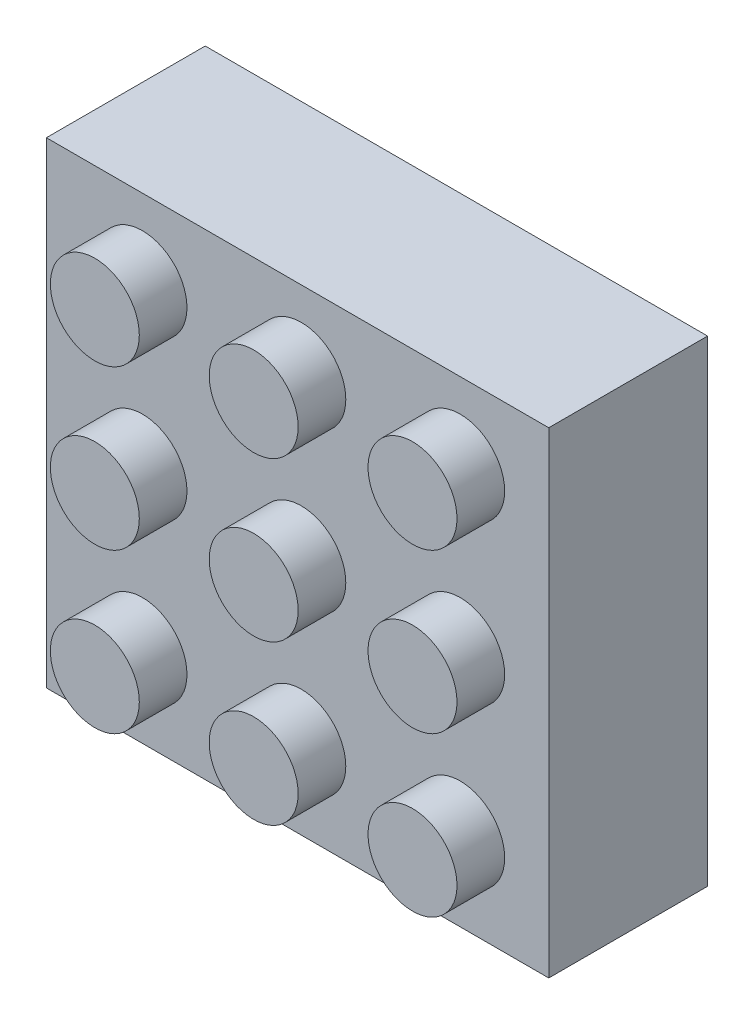
ISO-10303-21;
HEADER;
FILE_DESCRIPTION(('STEP AP214'),'2;1');
FILE_NAME('part.step','',(''),(''),'','','');
FILE_SCHEMA(('AUTOMOTIVE_DESIGN { 1 0 10303 214 1 1 1 1 }'));
ENDSEC;
DATA;
#1=APPLICATION_CONTEXT('core data for automotive mechanical design processes');
#2=APPLICATION_PROTOCOL_DEFINITION('international standard','automotive_design',2000,#1);
#3=PRODUCT_CONTEXT('',#1,'mechanical');
#4=PRODUCT('Part','Part','',(#3));
#5=PRODUCT_RELATED_PRODUCT_CATEGORY('part','',(#4));
#6=PRODUCT_DEFINITION_FORMATION('','',#4);
#7=PRODUCT_DEFINITION_CONTEXT('part definition',#1,'design');
#8=PRODUCT_DEFINITION('design','',#6,#7);
#9=PRODUCT_DEFINITION_SHAPE('','',#8);
#10=(LENGTH_UNIT() NAMED_UNIT(*) SI_UNIT(.MILLI.,.METRE.));
#11=(NAMED_UNIT(*) PLANE_ANGLE_UNIT() SI_UNIT($,.RADIAN.));
#12=(NAMED_UNIT(*) SI_UNIT($,.STERADIAN.) SOLID_ANGLE_UNIT());
#13=UNCERTAINTY_MEASURE_WITH_UNIT(LENGTH_MEASURE(1.E-05),#10,'distance_accuracy_value','');
#14=(GEOMETRIC_REPRESENTATION_CONTEXT(3) GLOBAL_UNCERTAINTY_ASSIGNED_CONTEXT((#13)) GLOBAL_UNIT_ASSIGNED_CONTEXT((#10,
#11,#12)) REPRESENTATION_CONTEXT('',''));
#15=CARTESIAN_POINT('',(0.,0.,0.));
#16=DIRECTION('',(0.,0.,1.));
#17=DIRECTION('',(1.,0.,0.));
#18=AXIS2_PLACEMENT_3D('',#15,#16,#17);
#19=CARTESIAN_POINT('',(1.53626923093681,-12.7149294337279,13.));
#20=DIRECTION('',(0.,0.,1.));
#21=DIRECTION('',(1.,0.,0.));
#22=AXIS2_PLACEMENT_3D('',#19,#20,#21);
#23=PLANE('',#22);
#24=CARTESIAN_POINT('',(1.53626923093681,-12.7149294337279,13.));
#25=DIRECTION('',(0.,0.,1.));
#26=DIRECTION('',(1.,0.,0.));
#27=AXIS2_PLACEMENT_3D('',#24,#25,#26);
#28=CIRCLE('',#27,2.8);
#29=CARTESIAN_POINT('',(4.3362692309368,-12.7149294337279,13.));
#30=VERTEX_POINT('',#29);
#31=EDGE_CURVE('E11',#30,#30,#28,.T.);
#32=ORIENTED_EDGE('',*,*,#31,.T.);
#33=EDGE_LOOP('',(#32));
#34=FACE_BOUND('',#33,.T.);
#35=ADVANCED_FACE('F33',(#34),#23,.T.);
#36=CARTESIAN_POINT('',(1.53626923093681,-12.7149294337279,13.));
#37=DIRECTION('',(0.,0.,-1.));
#38=DIRECTION('',(-1.,0.,0.));
#39=AXIS2_PLACEMENT_3D('',#36,#37,#38);
#40=CYLINDRICAL_SURFACE('',#39,2.8);
#41=ORIENTED_EDGE('',*,*,#31,.F.);
#42=EDGE_LOOP('',(#41));
#43=FACE_BOUND('',#42,.T.);
#44=CARTESIAN_POINT('',(1.53626923093681,-12.7149294337279,10.));
#45=DIRECTION('',(0.,0.,1.));
#46=DIRECTION('',(1.,0.,0.));
#47=AXIS2_PLACEMENT_3D('',#44,#45,#46);
#48=CIRCLE('',#47,2.8);
#49=CARTESIAN_POINT('',(4.3362692309368,-12.7149294337279,10.));
#50=VERTEX_POINT('',#49);
#51=EDGE_CURVE('E40',#50,#50,#48,.T.);
#52=ORIENTED_EDGE('',*,*,#51,.T.);
#53=EDGE_LOOP('',(#52));
#54=FACE_BOUND('',#53,.T.);
#55=ADVANCED_FACE('F141',(#43,#54),#40,.T.);
#56=CARTESIAN_POINT('',(-8.46373076906319,-12.7149294337279,13.));
#57=DIRECTION('',(0.,0.,1.));
#58=DIRECTION('',(1.,0.,0.));
#59=AXIS2_PLACEMENT_3D('',#56,#57,#58);
#60=PLANE('',#59);
#61=CARTESIAN_POINT('',(-8.46373076906319,-12.7149294337279,13.));
#62=DIRECTION('',(0.,0.,1.));
#63=DIRECTION('',(1.,0.,0.));
#64=AXIS2_PLACEMENT_3D('',#61,#62,#63);
#65=CIRCLE('',#64,2.8);
#66=CARTESIAN_POINT('',(-5.6637307690632,-12.7149294337279,13.));
#67=VERTEX_POINT('',#66);
#68=EDGE_CURVE('E136',#67,#67,#65,.T.);
#69=ORIENTED_EDGE('',*,*,#68,.T.);
#70=EDGE_LOOP('',(#69));
#71=FACE_BOUND('',#70,.T.);
#72=ADVANCED_FACE('F161',(#71),#60,.T.);
#73=CARTESIAN_POINT('',(-8.46373076906319,-12.7149294337279,13.));
#74=DIRECTION('',(0.,0.,-1.));
#75=DIRECTION('',(-1.,0.,0.));
#76=AXIS2_PLACEMENT_3D('',#73,#74,#75);
#77=CYLINDRICAL_SURFACE('',#76,2.8);
#78=ORIENTED_EDGE('',*,*,#68,.F.);
#79=EDGE_LOOP('',(#78));
#80=FACE_BOUND('',#79,.T.);
#81=CARTESIAN_POINT('',(-8.46373076906319,-12.7149294337279,10.));
#82=DIRECTION('',(0.,0.,1.));
#83=DIRECTION('',(1.,0.,0.));
#84=AXIS2_PLACEMENT_3D('',#81,#82,#83);
#85=CIRCLE('',#84,2.8);
#86=CARTESIAN_POINT('',(-5.6637307690632,-12.7149294337279,10.));
#87=VERTEX_POINT('',#86);
#88=EDGE_CURVE('E133',#87,#87,#85,.T.);
#89=ORIENTED_EDGE('',*,*,#88,.T.);
#90=EDGE_LOOP('',(#89));
#91=FACE_BOUND('',#90,.T.);
#92=ADVANCED_FACE('F167',(#80,#91),#77,.T.);
#93=CARTESIAN_POINT('',(-18.4637307690632,-12.7149294337279,13.));
#94=DIRECTION('',(0.,0.,1.));
#95=DIRECTION('',(1.,0.,0.));
#96=AXIS2_PLACEMENT_3D('',#93,#94,#95);
#97=PLANE('',#96);
#98=CARTESIAN_POINT('',(-18.4637307690632,-12.7149294337279,13.));
#99=DIRECTION('',(0.,0.,1.));
#100=DIRECTION('',(1.,0.,0.));
#101=AXIS2_PLACEMENT_3D('',#98,#99,#100);
#102=CIRCLE('',#101,2.8);
#103=CARTESIAN_POINT('',(-15.6637307690632,-12.7149294337279,13.));
#104=VERTEX_POINT('',#103);
#105=EDGE_CURVE('E130',#104,#104,#102,.T.);
#106=ORIENTED_EDGE('',*,*,#105,.T.);
#107=EDGE_LOOP('',(#106));
#108=FACE_BOUND('',#107,.T.);
#109=ADVANCED_FACE('F173',(#108),#97,.T.);
#110=CARTESIAN_POINT('',(-18.4637307690632,-12.7149294337279,13.));
#111=DIRECTION('',(0.,0.,-1.));
#112=DIRECTION('',(-1.,0.,0.));
#113=AXIS2_PLACEMENT_3D('',#110,#111,#112);
#114=CYLINDRICAL_SURFACE('',#113,2.8);
#115=ORIENTED_EDGE('',*,*,#105,.F.);
#116=EDGE_LOOP('',(#115));
#117=FACE_BOUND('',#116,.T.);
#118=CARTESIAN_POINT('',(-18.4637307690632,-12.7149294337279,10.));
#119=DIRECTION('',(0.,0.,1.));
#120=DIRECTION('',(1.,0.,0.));
#121=AXIS2_PLACEMENT_3D('',#118,#119,#120);
#122=CIRCLE('',#121,2.8);
#123=CARTESIAN_POINT('',(-15.6637307690632,-12.7149294337279,10.));
#124=VERTEX_POINT('',#123);
#125=EDGE_CURVE('E127',#124,#124,#122,.T.);
#126=ORIENTED_EDGE('',*,*,#125,.T.);
#127=EDGE_LOOP('',(#126));
#128=FACE_BOUND('',#127,.T.);
#129=ADVANCED_FACE('F177',(#117,#128),#114,.T.);
#130=CARTESIAN_POINT('',(1.53626923093681,-2.71492943372793,13.));
#131=DIRECTION('',(0.,0.,1.));
#132=DIRECTION('',(1.,0.,0.));
#133=AXIS2_PLACEMENT_3D('',#130,#131,#132);
#134=PLANE('',#133);
#135=CARTESIAN_POINT('',(1.53626923093681,-2.71492943372793,13.));
#136=DIRECTION('',(0.,0.,1.));
#137=DIRECTION('',(1.,0.,0.));
#138=AXIS2_PLACEMENT_3D('',#135,#136,#137);
#139=CIRCLE('',#138,2.8);
#140=CARTESIAN_POINT('',(4.3362692309368,-2.71492943372793,13.));
#141=VERTEX_POINT('',#140);
#142=EDGE_CURVE('E124',#141,#141,#139,.T.);
#143=ORIENTED_EDGE('',*,*,#142,.T.);
#144=EDGE_LOOP('',(#143));
#145=FACE_BOUND('',#144,.T.);
#146=ADVANCED_FACE('F181',(#145),#134,.T.);
#147=CARTESIAN_POINT('',(1.53626923093681,-2.71492943372793,13.));
#148=DIRECTION('',(0.,0.,-1.));
#149=DIRECTION('',(-1.,0.,0.));
#150=AXIS2_PLACEMENT_3D('',#147,#148,#149);
#151=CYLINDRICAL_SURFACE('',#150,2.8);
#152=ORIENTED_EDGE('',*,*,#142,.F.);
#153=EDGE_LOOP('',(#152));
#154=FACE_BOUND('',#153,.T.);
#155=CARTESIAN_POINT('',(1.53626923093681,-2.71492943372793,10.));
#156=DIRECTION('',(0.,0.,1.));
#157=DIRECTION('',(1.,0.,0.));
#158=AXIS2_PLACEMENT_3D('',#155,#156,#157);
#159=CIRCLE('',#158,2.8);
#160=CARTESIAN_POINT('',(4.3362692309368,-2.71492943372793,10.));
#161=VERTEX_POINT('',#160);
#162=EDGE_CURVE('E121',#161,#161,#159,.T.);
#163=ORIENTED_EDGE('',*,*,#162,.T.);
#164=EDGE_LOOP('',(#163));
#165=FACE_BOUND('',#164,.T.);
#166=ADVANCED_FACE('F185',(#154,#165),#151,.T.);
#167=CARTESIAN_POINT('',(-8.46373076906319,-2.71492943372793,13.));
#168=DIRECTION('',(0.,0.,1.));
#169=DIRECTION('',(1.,0.,0.));
#170=AXIS2_PLACEMENT_3D('',#167,#168,#169);
#171=PLANE('',#170);
#172=CARTESIAN_POINT('',(-8.46373076906319,-2.71492943372793,13.));
#173=DIRECTION('',(0.,0.,1.));
#174=DIRECTION('',(1.,0.,0.));
#175=AXIS2_PLACEMENT_3D('',#172,#173,#174);
#176=CIRCLE('',#175,2.8);
#177=CARTESIAN_POINT('',(-5.6637307690632,-2.71492943372793,13.));
#178=VERTEX_POINT('',#177);
#179=EDGE_CURVE('E118',#178,#178,#176,.T.);
#180=ORIENTED_EDGE('',*,*,#179,.T.);
#181=EDGE_LOOP('',(#180));
#182=FACE_BOUND('',#181,.T.);
#183=ADVANCED_FACE('F189',(#182),#171,.T.);
#184=CARTESIAN_POINT('',(-8.46373076906319,-2.71492943372793,13.));
#185=DIRECTION('',(0.,0.,-1.));
#186=DIRECTION('',(-1.,0.,0.));
#187=AXIS2_PLACEMENT_3D('',#184,#185,#186);
#188=CYLINDRICAL_SURFACE('',#187,2.8);
#189=ORIENTED_EDGE('',*,*,#179,.F.);
#190=EDGE_LOOP('',(#189));
#191=FACE_BOUND('',#190,.T.);
#192=CARTESIAN_POINT('',(-8.46373076906319,-2.71492943372793,10.));
#193=DIRECTION('',(0.,0.,1.));
#194=DIRECTION('',(1.,0.,0.));
#195=AXIS2_PLACEMENT_3D('',#192,#193,#194);
#196=CIRCLE('',#195,2.8);
#197=CARTESIAN_POINT('',(-5.6637307690632,-2.71492943372793,10.));
#198=VERTEX_POINT('',#197);
#199=EDGE_CURVE('E115',#198,#198,#196,.T.);
#200=ORIENTED_EDGE('',*,*,#199,.T.);
#201=EDGE_LOOP('',(#200));
#202=FACE_BOUND('',#201,.T.);
#203=ADVANCED_FACE('F193',(#191,#202),#188,.T.);
#204=CARTESIAN_POINT('',(-18.4637307690632,-2.71492943372793,13.));
#205=DIRECTION('',(0.,0.,1.));
#206=DIRECTION('',(1.,0.,0.));
#207=AXIS2_PLACEMENT_3D('',#204,#205,#206);
#208=PLANE('',#207);
#209=CARTESIAN_POINT('',(-18.4637307690632,-2.71492943372793,13.));
#210=DIRECTION('',(0.,0.,1.));
#211=DIRECTION('',(1.,0.,0.));
#212=AXIS2_PLACEMENT_3D('',#209,#210,#211);
#213=CIRCLE('',#212,2.8);
#214=CARTESIAN_POINT('',(-15.6637307690632,-2.71492943372793,13.));
#215=VERTEX_POINT('',#214);
#216=EDGE_CURVE('E112',#215,#215,#213,.T.);
#217=ORIENTED_EDGE('',*,*,#216,.T.);
#218=EDGE_LOOP('',(#217));
#219=FACE_BOUND('',#218,.T.);
#220=ADVANCED_FACE('F197',(#219),#208,.T.);
#221=CARTESIAN_POINT('',(-18.4637307690632,-2.71492943372793,13.));
#222=DIRECTION('',(0.,0.,-1.));
#223=DIRECTION('',(-1.,0.,0.));
#224=AXIS2_PLACEMENT_3D('',#221,#222,#223);
#225=CYLINDRICAL_SURFACE('',#224,2.8);
#226=ORIENTED_EDGE('',*,*,#216,.F.);
#227=EDGE_LOOP('',(#226));
#228=FACE_BOUND('',#227,.T.);
#229=CARTESIAN_POINT('',(-18.4637307690632,-2.71492943372793,10.));
#230=DIRECTION('',(0.,0.,1.));
#231=DIRECTION('',(1.,0.,0.));
#232=AXIS2_PLACEMENT_3D('',#229,#230,#231);
#233=CIRCLE('',#232,2.8);
#234=CARTESIAN_POINT('',(-15.6637307690632,-2.71492943372793,10.));
#235=VERTEX_POINT('',#234);
#236=EDGE_CURVE('E109',#235,#235,#233,.T.);
#237=ORIENTED_EDGE('',*,*,#236,.T.);
#238=EDGE_LOOP('',(#237));
#239=FACE_BOUND('',#238,.T.);
#240=ADVANCED_FACE('F201',(#228,#239),#225,.T.);
#241=CARTESIAN_POINT('',(1.53626923093681,7.28507056627207,13.));
#242=DIRECTION('',(0.,0.,1.));
#243=DIRECTION('',(1.,0.,0.));
#244=AXIS2_PLACEMENT_3D('',#241,#242,#243);
#245=PLANE('',#244);
#246=CARTESIAN_POINT('',(1.53626923093681,7.28507056627207,13.));
#247=DIRECTION('',(0.,0.,1.));
#248=DIRECTION('',(1.,0.,0.));
#249=AXIS2_PLACEMENT_3D('',#246,#247,#248);
#250=CIRCLE('',#249,2.8);
#251=CARTESIAN_POINT('',(4.3362692309368,7.28507056627207,13.));
#252=VERTEX_POINT('',#251);
#253=EDGE_CURVE('E106',#252,#252,#250,.T.);
#254=ORIENTED_EDGE('',*,*,#253,.T.);
#255=EDGE_LOOP('',(#254));
#256=FACE_BOUND('',#255,.T.);
#257=ADVANCED_FACE('F205',(#256),#245,.T.);
#258=CARTESIAN_POINT('',(1.53626923093681,7.28507056627207,13.));
#259=DIRECTION('',(0.,0.,-1.));
#260=DIRECTION('',(-1.,0.,0.));
#261=AXIS2_PLACEMENT_3D('',#258,#259,#260);
#262=CYLINDRICAL_SURFACE('',#261,2.8);
#263=ORIENTED_EDGE('',*,*,#253,.F.);
#264=EDGE_LOOP('',(#263));
#265=FACE_BOUND('',#264,.T.);
#266=CARTESIAN_POINT('',(1.53626923093681,7.28507056627207,10.));
#267=DIRECTION('',(0.,0.,1.));
#268=DIRECTION('',(1.,0.,0.));
#269=AXIS2_PLACEMENT_3D('',#266,#267,#268);
#270=CIRCLE('',#269,2.8);
#271=CARTESIAN_POINT('',(4.3362692309368,7.28507056627207,10.));
#272=VERTEX_POINT('',#271);
#273=EDGE_CURVE('E103',#272,#272,#270,.T.);
#274=ORIENTED_EDGE('',*,*,#273,.T.);
#275=EDGE_LOOP('',(#274));
#276=FACE_BOUND('',#275,.T.);
#277=ADVANCED_FACE('F209',(#265,#276),#262,.T.);
#278=CARTESIAN_POINT('',(-24.5125871846065,12.1293913556656,10.));
#279=DIRECTION('',(1.,0.,0.));
#280=DIRECTION('',(0.,0.,-1.));
#281=AXIS2_PLACEMENT_3D('',#278,#279,#280);
#282=PLANE('',#281);
#283=DIRECTION('',(0.,-1.,0.));
#284=VECTOR('',#283,1.);
#285=CARTESIAN_POINT('',(-24.5125871846065,12.1293913556656,0.));
#286=LINE('',#285,#284);
#287=CARTESIAN_POINT('',(-24.5125871846065,12.1293913556656,0.));
#288=VERTEX_POINT('',#287);
#289=CARTESIAN_POINT('',(-24.5125871846065,-17.8706086443344,0.));
#290=VERTEX_POINT('',#289);
#291=EDGE_CURVE('E87',#288,#290,#286,.T.);
#292=ORIENTED_EDGE('',*,*,#291,.T.);
#293=DIRECTION('',(0.,0.,-1.));
#294=VECTOR('',#293,1.);
#295=CARTESIAN_POINT('',(-24.5125871846065,-17.8706086443344,10.));
#296=LINE('',#295,#294);
#297=CARTESIAN_POINT('',(-24.5125871846065,-17.8706086443344,10.));
#298=VERTEX_POINT('',#297);
#299=EDGE_CURVE('E88',#298,#290,#296,.T.);
#300=ORIENTED_EDGE('',*,*,#299,.F.);
#301=DIRECTION('',(0.,-1.,0.));
#302=VECTOR('',#301,1.);
#303=CARTESIAN_POINT('',(-24.5125871846065,12.1293913556656,10.));
#304=LINE('',#303,#302);
#305=CARTESIAN_POINT('',(-24.5125871846065,12.1293913556656,10.));
#306=VERTEX_POINT('',#305);
#307=EDGE_CURVE('E80',#306,#298,#304,.T.);
#308=ORIENTED_EDGE('',*,*,#307,.F.);
#309=DIRECTION('',(0.,0.,-1.));
#310=VECTOR('',#309,1.);
#311=CARTESIAN_POINT('',(-24.5125871846065,12.1293913556656,10.));
#312=LINE('',#311,#310);
#313=EDGE_CURVE('E73',#306,#288,#312,.T.);
#314=ORIENTED_EDGE('',*,*,#313,.T.);
#315=EDGE_LOOP('',(#292,#300,#308,#314));
#316=FACE_BOUND('',#315,.T.);
#317=ADVANCED_FACE('F85',(#316),#282,.F.);
#318=CARTESIAN_POINT('',(-24.5125871846065,-17.8706086443344,10.));
#319=DIRECTION('',(0.,1.,0.));
#320=DIRECTION('',(0.,0.,1.));
#321=AXIS2_PLACEMENT_3D('',#318,#319,#320);
#322=PLANE('',#321);
#323=DIRECTION('',(1.,0.,0.));
#324=VECTOR('',#323,1.);
#325=CARTESIAN_POINT('',(-24.5125871846065,-17.8706086443344,0.));
#326=LINE('',#325,#324);
#327=CARTESIAN_POINT('',(7.11354499704358,-17.8706086443344,0.));
#328=VERTEX_POINT('',#327);
#329=EDGE_CURVE('E81',#290,#328,#326,.T.);
#330=ORIENTED_EDGE('',*,*,#329,.T.);
#331=DIRECTION('',(0.,0.,-1.));
#332=VECTOR('',#331,1.);
#333=CARTESIAN_POINT('',(7.11354499704358,-17.8706086443344,13.));
#334=LINE('',#333,#332);
#335=CARTESIAN_POINT('',(7.11354499704358,-17.8706086443344,10.));
#336=VERTEX_POINT('',#335);
#337=EDGE_CURVE('E47',#336,#328,#334,.T.);
#338=ORIENTED_EDGE('',*,*,#337,.F.);
#339=DIRECTION('',(1.,0.,0.));
#340=VECTOR('',#339,1.);
#341=CARTESIAN_POINT('',(-24.5125871846065,-17.8706086443344,10.));
#342=LINE('',#341,#340);
#343=EDGE_CURVE('E222',#298,#336,#342,.T.);
#344=ORIENTED_EDGE('',*,*,#343,.F.);
#345=ORIENTED_EDGE('',*,*,#299,.T.);
#346=EDGE_LOOP('',(#330,#338,#344,#345));
#347=FACE_BOUND('',#346,.T.);
#348=ADVANCED_FACE('F152',(#347),#322,.F.);
#349=CARTESIAN_POINT('',(-24.5125871846065,12.1293913556656,10.));
#350=DIRECTION('',(0.,-1.,0.));
#351=DIRECTION('',(0.,0.,-1.));
#352=AXIS2_PLACEMENT_3D('',#349,#350,#351);
#353=PLANE('',#352);
#354=DIRECTION('',(-1.,0.,0.));
#355=VECTOR('',#354,1.);
#356=CARTESIAN_POINT('',(-24.5125871846065,12.1293913556656,10.));
#357=LINE('',#356,#355);
#358=CARTESIAN_POINT('',(7.11354499704358,12.1293913556656,10.));
#359=VERTEX_POINT('',#358);
#360=EDGE_CURVE('E56',#359,#306,#357,.T.);
#361=ORIENTED_EDGE('',*,*,#360,.F.);
#362=DIRECTION('',(0.,0.,-1.));
#363=VECTOR('',#362,1.);
#364=CARTESIAN_POINT('',(7.11354499704358,12.1293913556656,13.));
#365=LINE('',#364,#363);
#366=CARTESIAN_POINT('',(7.11354499704358,12.1293913556656,0.));
#367=VERTEX_POINT('',#366);
#368=EDGE_CURVE('E77',#359,#367,#365,.T.);
#369=ORIENTED_EDGE('',*,*,#368,.T.);
#370=DIRECTION('',(-1.,0.,0.));
#371=VECTOR('',#370,1.);
#372=CARTESIAN_POINT('',(-24.5125871846065,12.1293913556656,0.));
#373=LINE('',#372,#371);
#374=EDGE_CURVE('E70',#367,#288,#373,.T.);
#375=ORIENTED_EDGE('',*,*,#374,.T.);
#376=ORIENTED_EDGE('',*,*,#313,.F.);
#377=EDGE_LOOP('',(#361,#369,#375,#376));
#378=FACE_BOUND('',#377,.T.);
#379=ADVANCED_FACE('F72',(#378),#353,.F.);
#380=CARTESIAN_POINT('',(0.,0.,10.));
#381=DIRECTION('',(0.,0.,1.));
#382=DIRECTION('',(1.,0.,0.));
#383=AXIS2_PLACEMENT_3D('',#380,#381,#382);
#384=PLANE('',#383);
#385=DIRECTION('',(0.,-1.,0.));
#386=VECTOR('',#385,1.);
#387=CARTESIAN_POINT('',(7.11354499704358,0.,10.));
#388=LINE('',#387,#386);
#389=EDGE_CURVE('E233',#359,#336,#388,.T.);
#390=ORIENTED_EDGE('',*,*,#389,.F.);
#391=ORIENTED_EDGE('',*,*,#360,.T.);
#392=ORIENTED_EDGE('',*,*,#307,.T.);
#393=ORIENTED_EDGE('',*,*,#343,.T.);
#394=EDGE_LOOP('',(#390,#391,#392,#393));
#395=FACE_BOUND('',#394,.T.);
#396=CARTESIAN_POINT('',(-8.46373076906319,7.28507056627207,10.));
#397=DIRECTION('',(0.,0.,1.));
#398=DIRECTION('',(1.,0.,0.));
#399=AXIS2_PLACEMENT_3D('',#396,#397,#398);
#400=CIRCLE('',#399,2.8);
#401=CARTESIAN_POINT('',(-5.6637307690632,7.28507056627207,10.));
#402=VERTEX_POINT('',#401);
#403=EDGE_CURVE('E230',#402,#402,#400,.T.);
#404=ORIENTED_EDGE('',*,*,#403,.F.);
#405=EDGE_LOOP('',(#404));
#406=FACE_BOUND('',#405,.T.);
#407=CARTESIAN_POINT('',(-18.4637307690632,7.28507056627207,10.));
#408=DIRECTION('',(0.,0.,1.));
#409=DIRECTION('',(1.,0.,0.));
#410=AXIS2_PLACEMENT_3D('',#407,#408,#409);
#411=CIRCLE('',#410,2.8);
#412=CARTESIAN_POINT('',(-15.6637307690632,7.28507056627207,10.));
#413=VERTEX_POINT('',#412);
#414=EDGE_CURVE('E97',#413,#413,#411,.T.);
#415=ORIENTED_EDGE('',*,*,#414,.F.);
#416=EDGE_LOOP('',(#415));
#417=FACE_BOUND('',#416,.T.);
#418=ORIENTED_EDGE('',*,*,#273,.F.);
#419=EDGE_LOOP('',(#418));
#420=FACE_BOUND('',#419,.T.);
#421=ORIENTED_EDGE('',*,*,#236,.F.);
#422=EDGE_LOOP('',(#421));
#423=FACE_BOUND('',#422,.T.);
#424=ORIENTED_EDGE('',*,*,#199,.F.);
#425=EDGE_LOOP('',(#424));
#426=FACE_BOUND('',#425,.T.);
#427=ORIENTED_EDGE('',*,*,#162,.F.);
#428=EDGE_LOOP('',(#427));
#429=FACE_BOUND('',#428,.T.);
#430=ORIENTED_EDGE('',*,*,#125,.F.);
#431=EDGE_LOOP('',(#430));
#432=FACE_BOUND('',#431,.T.);
#433=ORIENTED_EDGE('',*,*,#88,.F.);
#434=EDGE_LOOP('',(#433));
#435=FACE_BOUND('',#434,.T.);
#436=ORIENTED_EDGE('',*,*,#51,.F.);
#437=EDGE_LOOP('',(#436));
#438=FACE_BOUND('',#437,.T.);
#439=ADVANCED_FACE('F143',(#395,#406,#417,#420,#423,#426,#429,#432,#435,#438),#384,.T.);
#440=CARTESIAN_POINT('',(0.,0.,0.));
#441=DIRECTION('',(0.,0.,1.));
#442=DIRECTION('',(1.,0.,0.));
#443=AXIS2_PLACEMENT_3D('',#440,#441,#442);
#444=PLANE('',#443);
#445=ORIENTED_EDGE('',*,*,#374,.F.);
#446=DIRECTION('',(0.,1.,0.));
#447=VECTOR('',#446,1.);
#448=CARTESIAN_POINT('',(7.11354499704358,12.1293913556656,0.));
#449=LINE('',#448,#447);
#450=EDGE_CURVE('E236',#328,#367,#449,.T.);
#451=ORIENTED_EDGE('',*,*,#450,.F.);
#452=ORIENTED_EDGE('',*,*,#329,.F.);
#453=ORIENTED_EDGE('',*,*,#291,.F.);
#454=EDGE_LOOP('',(#445,#451,#452,#453));
#455=FACE_BOUND('',#454,.T.);
#456=ADVANCED_FACE('F90',(#455),#444,.F.);
#457=CARTESIAN_POINT('',(-18.4637307690632,7.28507056627207,13.));
#458=DIRECTION('',(0.,0.,-1.));
#459=DIRECTION('',(-1.,0.,0.));
#460=AXIS2_PLACEMENT_3D('',#457,#458,#459);
#461=CYLINDRICAL_SURFACE('',#460,2.8);
#462=CARTESIAN_POINT('',(-18.4637307690632,7.28507056627207,13.));
#463=DIRECTION('',(0.,0.,1.));
#464=DIRECTION('',(1.,0.,0.));
#465=AXIS2_PLACEMENT_3D('',#462,#463,#464);
#466=CIRCLE('',#465,2.8);
#467=CARTESIAN_POINT('',(-15.6637307690632,7.28507056627207,13.));
#468=VERTEX_POINT('',#467);
#469=EDGE_CURVE('E93',#468,#468,#466,.T.);
#470=ORIENTED_EDGE('',*,*,#469,.F.);
#471=EDGE_LOOP('',(#470));
#472=FACE_BOUND('',#471,.T.);
#473=ORIENTED_EDGE('',*,*,#414,.T.);
#474=EDGE_LOOP('',(#473));
#475=FACE_BOUND('',#474,.T.);
#476=ADVANCED_FACE('F150',(#472,#475),#461,.T.);
#477=CARTESIAN_POINT('',(-18.4637307690632,7.28507056627207,13.));
#478=DIRECTION('',(0.,0.,1.));
#479=DIRECTION('',(1.,0.,0.));
#480=AXIS2_PLACEMENT_3D('',#477,#478,#479);
#481=PLANE('',#480);
#482=ORIENTED_EDGE('',*,*,#469,.T.);
#483=EDGE_LOOP('',(#482));
#484=FACE_BOUND('',#483,.T.);
#485=ADVANCED_FACE('F253',(#484),#481,.T.);
#486=CARTESIAN_POINT('',(-8.46373076906319,7.28507056627207,13.));
#487=DIRECTION('',(0.,0.,-1.));
#488=DIRECTION('',(-1.,0.,0.));
#489=AXIS2_PLACEMENT_3D('',#486,#487,#488);
#490=CYLINDRICAL_SURFACE('',#489,2.8);
#491=CARTESIAN_POINT('',(-8.46373076906319,7.28507056627207,13.));
#492=DIRECTION('',(0.,0.,1.));
#493=DIRECTION('',(1.,0.,0.));
#494=AXIS2_PLACEMENT_3D('',#491,#492,#493);
#495=CIRCLE('',#494,2.8);
#496=CARTESIAN_POINT('',(-5.6637307690632,7.28507056627207,13.));
#497=VERTEX_POINT('',#496);
#498=EDGE_CURVE('E226',#497,#497,#495,.T.);
#499=ORIENTED_EDGE('',*,*,#498,.F.);
#500=EDGE_LOOP('',(#499));
#501=FACE_BOUND('',#500,.T.);
#502=ORIENTED_EDGE('',*,*,#403,.T.);
#503=EDGE_LOOP('',(#502));
#504=FACE_BOUND('',#503,.T.);
#505=ADVANCED_FACE('F247',(#501,#504),#490,.T.);
#506=CARTESIAN_POINT('',(-8.46373076906319,7.28507056627207,13.));
#507=DIRECTION('',(0.,0.,1.));
#508=DIRECTION('',(1.,0.,0.));
#509=AXIS2_PLACEMENT_3D('',#506,#507,#508);
#510=PLANE('',#509);
#511=ORIENTED_EDGE('',*,*,#498,.T.);
#512=EDGE_LOOP('',(#511));
#513=FACE_BOUND('',#512,.T.);
#514=ADVANCED_FACE('F242',(#513),#510,.T.);
#515=CARTESIAN_POINT('',(7.11354499704358,12.1293913556656,13.));
#516=DIRECTION('',(-1.,0.,0.));
#517=DIRECTION('',(0.,0.,1.));
#518=AXIS2_PLACEMENT_3D('',#515,#516,#517);
#519=PLANE('',#518);
#520=ORIENTED_EDGE('',*,*,#389,.T.);
#521=ORIENTED_EDGE('',*,*,#337,.T.);
#522=ORIENTED_EDGE('',*,*,#450,.T.);
#523=ORIENTED_EDGE('',*,*,#368,.F.);
#524=EDGE_LOOP('',(#520,#521,#522,#523));
#525=FACE_BOUND('',#524,.T.);
#526=ADVANCED_FACE('F238',(#525),#519,.F.);
#527=CLOSED_SHELL('',(#35,#55,#72,#92,#109,#129,#146,#166,#183,#203,#220,#240,#257,#277,#317,
#348,#379,#439,#456,#476,#485,#505,#514,#526));
#528=MANIFOLD_SOLID_BREP('B2',#527);
#529=ADVANCED_BREP_SHAPE_REPRESENTATION('',(#18,#528),#14);
#530=SHAPE_DEFINITION_REPRESENTATION(#9,#529);
ENDSEC;
END-ISO-10303-21;
